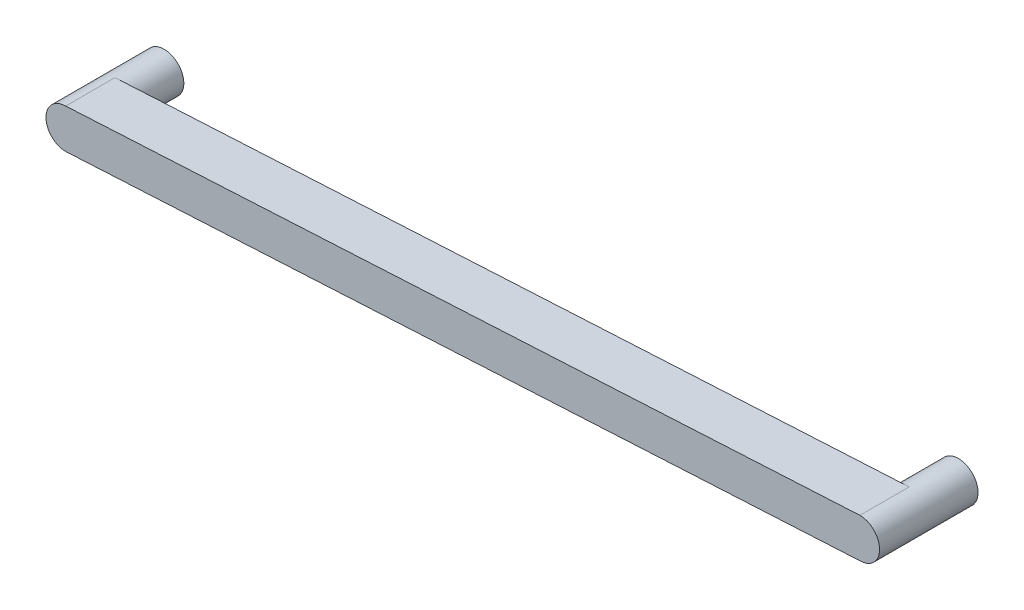
ISO-10303-21;
HEADER;
FILE_DESCRIPTION(('STEP AP214'),'2;1');
FILE_NAME('part.step','',(''),(''),'','','');
FILE_SCHEMA(('AUTOMOTIVE_DESIGN { 1 0 10303 214 1 1 1 1 }'));
ENDSEC;
DATA;
#1=APPLICATION_CONTEXT('core data for automotive mechanical design processes');
#2=APPLICATION_PROTOCOL_DEFINITION('international standard','automotive_design',2000,#1);
#3=PRODUCT_CONTEXT('',#1,'mechanical');
#4=PRODUCT('Part','Part','',(#3));
#5=PRODUCT_RELATED_PRODUCT_CATEGORY('part','',(#4));
#6=PRODUCT_DEFINITION_FORMATION('','',#4);
#7=PRODUCT_DEFINITION_CONTEXT('part definition',#1,'design');
#8=PRODUCT_DEFINITION('design','',#6,#7);
#9=PRODUCT_DEFINITION_SHAPE('','',#8);
#10=(LENGTH_UNIT() NAMED_UNIT(*) SI_UNIT(.MILLI.,.METRE.));
#11=(NAMED_UNIT(*) PLANE_ANGLE_UNIT() SI_UNIT($,.RADIAN.));
#12=(NAMED_UNIT(*) SI_UNIT($,.STERADIAN.) SOLID_ANGLE_UNIT());
#13=UNCERTAINTY_MEASURE_WITH_UNIT(LENGTH_MEASURE(1.E-05),#10,'distance_accuracy_value','');
#14=(GEOMETRIC_REPRESENTATION_CONTEXT(3) GLOBAL_UNCERTAINTY_ASSIGNED_CONTEXT((#13)) GLOBAL_UNIT_ASSIGNED_CONTEXT((#10,
#11,#12)) REPRESENTATION_CONTEXT('',''));
#15=CARTESIAN_POINT('',(0.,0.,0.));
#16=DIRECTION('',(0.,0.,1.));
#17=DIRECTION('',(1.,0.,0.));
#18=AXIS2_PLACEMENT_3D('',#15,#16,#17);
#19=CARTESIAN_POINT('',(0.,0.,1.5));
#20=DIRECTION('',(0.,0.,-1.));
#21=DIRECTION('',(-1.,0.,0.));
#22=AXIS2_PLACEMENT_3D('',#19,#20,#21);
#23=CYLINDRICAL_SURFACE('',#22,0.6);
#24=DIRECTION('',(0.,0.,-1.));
#25=VECTOR('',#24,1.);
#26=CARTESIAN_POINT('',(0.,0.6,1.5));
#27=LINE('',#26,#25);
#28=CARTESIAN_POINT('',(0.,0.6,1.5));
#29=VERTEX_POINT('',#28);
#30=CARTESIAN_POINT('',(0.,0.6,0.));
#31=VERTEX_POINT('',#30);
#32=EDGE_CURVE('E123',#29,#31,#27,.T.);
#33=ORIENTED_EDGE('',*,*,#32,.T.);
#34=CARTESIAN_POINT('',(0.,0.,0.));
#35=DIRECTION('',(0.,0.,-1.));
#36=DIRECTION('',(-1.,0.,0.));
#37=AXIS2_PLACEMENT_3D('',#34,#35,#36);
#38=CIRCLE('',#37,0.6);
#39=CARTESIAN_POINT('',(0.0642773227997892,-0.5965470859653,0.));
#40=VERTEX_POINT('',#39);
#41=EDGE_CURVE('E91',#31,#40,#38,.T.);
#42=ORIENTED_EDGE('',*,*,#41,.T.);
#43=CARTESIAN_POINT('',(0.,-0.6,0.));
#44=DIRECTION('',(0.998560249377948,0.053641666288898,0.));
#45=VECTOR('',#44,1.);
#46=LINE('',#43,#45);
#47=CARTESIAN_POINT('',(0.,-0.6,0.));
#48=VERTEX_POINT('',#47);
#49=EDGE_CURVE('E104',#48,#40,#46,.T.);
#50=ORIENTED_EDGE('',*,*,#49,.F.);
#51=DIRECTION('',(0.,0.,-1.));
#52=VECTOR('',#51,1.);
#53=CARTESIAN_POINT('',(0.,-0.6,1.5));
#54=LINE('',#53,#52);
#55=CARTESIAN_POINT('',(0.,-0.6,1.5));
#56=VERTEX_POINT('',#55);
#57=EDGE_CURVE('E57',#56,#48,#54,.T.);
#58=ORIENTED_EDGE('',*,*,#57,.F.);
#59=CARTESIAN_POINT('',(0.,0.,1.5));
#60=DIRECTION('',(0.,0.,1.));
#61=DIRECTION('',(1.,0.,0.));
#62=AXIS2_PLACEMENT_3D('',#59,#60,#61);
#63=CIRCLE('',#62,0.6);
#64=EDGE_CURVE('E136',#29,#56,#63,.T.);
#65=ORIENTED_EDGE('',*,*,#64,.F.);
#66=EDGE_LOOP('',(#33,#42,#50,#58,#65));
#67=FACE_BOUND('',#66,.T.);
#68=CARTESIAN_POINT('',(0.,0.,-1.5));
#69=DIRECTION('',(0.,0.,-1.));
#70=DIRECTION('',(-1.,0.,0.));
#71=AXIS2_PLACEMENT_3D('',#68,#69,#70);
#72=CIRCLE('',#71,0.6);
#73=CARTESIAN_POINT('',(-0.6,0.,-1.5));
#74=VERTEX_POINT('',#73);
#75=EDGE_CURVE('E125',#74,#74,#72,.T.);
#76=ORIENTED_EDGE('',*,*,#75,.F.);
#77=EDGE_LOOP('',(#76));
#78=FACE_BOUND('',#77,.T.);
#79=ADVANCED_FACE('F45',(#67,#78),#23,.T.);
#80=CARTESIAN_POINT('',(0.,-0.6,1.5));
#81=DIRECTION('',(-0.053641666288898,0.998560249377948,0.));
#82=DIRECTION('',(-0.998560249377948,-0.053641666288898,0.));
#83=AXIS2_PLACEMENT_3D('',#80,#81,#82);
#84=PLANE('',#83);
#85=ORIENTED_EDGE('',*,*,#49,.T.);
#86=DIRECTION('',(0.998560249377948,0.053641666288898,0.));
#87=VECTOR('',#86,1.);
#88=CARTESIAN_POINT('',(0.,-0.6,0.));
#89=LINE('',#88,#87);
#90=CARTESIAN_POINT('',(24.2,0.7,0.));
#91=VERTEX_POINT('',#90);
#92=EDGE_CURVE('E107',#40,#91,#89,.T.);
#93=ORIENTED_EDGE('',*,*,#92,.T.);
#94=DIRECTION('',(0.,0.,-1.));
#95=VECTOR('',#94,1.);
#96=CARTESIAN_POINT('',(24.2,0.7,1.5));
#97=LINE('',#96,#95);
#98=CARTESIAN_POINT('',(24.2,0.7,1.5));
#99=VERTEX_POINT('',#98);
#100=EDGE_CURVE('E149',#99,#91,#97,.T.);
#101=ORIENTED_EDGE('',*,*,#100,.F.);
#102=DIRECTION('',(0.998560249377948,0.053641666288898,0.));
#103=VECTOR('',#102,1.);
#104=CARTESIAN_POINT('',(0.,-0.6,1.5));
#105=LINE('',#104,#103);
#106=EDGE_CURVE('E98',#56,#99,#105,.T.);
#107=ORIENTED_EDGE('',*,*,#106,.F.);
#108=ORIENTED_EDGE('',*,*,#57,.T.);
#109=EDGE_LOOP('',(#85,#93,#101,#107,#108));
#110=FACE_BOUND('',#109,.T.);
#111=ADVANCED_FACE('F106',(#110),#84,.F.);
#112=CARTESIAN_POINT('',(24.2,1.3,1.5));
#113=DIRECTION('',(0.,0.,-1.));
#114=DIRECTION('',(-1.,0.,0.));
#115=AXIS2_PLACEMENT_3D('',#112,#113,#114);
#116=CYLINDRICAL_SURFACE('',#115,0.6);
#117=ORIENTED_EDGE('',*,*,#100,.T.);
#118=CARTESIAN_POINT('',(24.2,1.3,0.));
#119=DIRECTION('',(0.,0.,-1.));
#120=DIRECTION('',(-1.,0.,0.));
#121=AXIS2_PLACEMENT_3D('',#118,#119,#120);
#122=CIRCLE('',#121,0.6);
#123=CARTESIAN_POINT('',(24.1357226772002,1.8965470859653,0.));
#124=VERTEX_POINT('',#123);
#125=EDGE_CURVE('E11',#91,#124,#122,.T.);
#126=ORIENTED_EDGE('',*,*,#125,.T.);
#127=CARTESIAN_POINT('',(24.2,1.9,0.));
#128=DIRECTION('',(-0.998560249377949,-0.0536416662888963,0.));
#129=VECTOR('',#128,1.);
#130=LINE('',#127,#129);
#131=CARTESIAN_POINT('',(24.2,1.9,0.));
#132=VERTEX_POINT('',#131);
#133=EDGE_CURVE('E139',#132,#124,#130,.T.);
#134=ORIENTED_EDGE('',*,*,#133,.F.);
#135=DIRECTION('',(0.,0.,-1.));
#136=VECTOR('',#135,1.);
#137=CARTESIAN_POINT('',(24.2,1.9,1.5));
#138=LINE('',#137,#136);
#139=CARTESIAN_POINT('',(24.2,1.9,1.5));
#140=VERTEX_POINT('',#139);
#141=EDGE_CURVE('E83',#140,#132,#138,.T.);
#142=ORIENTED_EDGE('',*,*,#141,.F.);
#143=CARTESIAN_POINT('',(24.2,1.3,1.5));
#144=DIRECTION('',(0.,0.,1.));
#145=DIRECTION('',(1.,0.,0.));
#146=AXIS2_PLACEMENT_3D('',#143,#144,#145);
#147=CIRCLE('',#146,0.6);
#148=EDGE_CURVE('E142',#99,#140,#147,.T.);
#149=ORIENTED_EDGE('',*,*,#148,.F.);
#150=EDGE_LOOP('',(#117,#126,#134,#142,#149));
#151=FACE_BOUND('',#150,.T.);
#152=CARTESIAN_POINT('',(24.2,1.3,-1.5));
#153=DIRECTION('',(0.,0.,-1.));
#154=DIRECTION('',(-1.,0.,0.));
#155=AXIS2_PLACEMENT_3D('',#152,#153,#154);
#156=CIRCLE('',#155,0.6);
#157=CARTESIAN_POINT('',(23.6,1.3,-1.5));
#158=VERTEX_POINT('',#157);
#159=EDGE_CURVE('E118',#158,#158,#156,.T.);
#160=ORIENTED_EDGE('',*,*,#159,.F.);
#161=EDGE_LOOP('',(#160));
#162=FACE_BOUND('',#161,.T.);
#163=ADVANCED_FACE('F167',(#151,#162),#116,.T.);
#164=CARTESIAN_POINT('',(0.,0.6,1.5));
#165=DIRECTION('',(0.053641666288898,-0.998560249377948,0.));
#166=DIRECTION('',(0.998560249377948,0.053641666288898,0.));
#167=AXIS2_PLACEMENT_3D('',#164,#165,#166);
#168=PLANE('',#167);
#169=ORIENTED_EDGE('',*,*,#133,.T.);
#170=DIRECTION('',(-0.998560249377948,-0.053641666288898,0.));
#171=VECTOR('',#170,1.);
#172=CARTESIAN_POINT('',(0.,0.6,0.));
#173=LINE('',#172,#171);
#174=EDGE_CURVE('E112',#124,#31,#173,.T.);
#175=ORIENTED_EDGE('',*,*,#174,.T.);
#176=ORIENTED_EDGE('',*,*,#32,.F.);
#177=DIRECTION('',(-0.998560249377948,-0.053641666288898,0.));
#178=VECTOR('',#177,1.);
#179=CARTESIAN_POINT('',(0.,0.6,1.5));
#180=LINE('',#179,#178);
#181=EDGE_CURVE('E66',#140,#29,#180,.T.);
#182=ORIENTED_EDGE('',*,*,#181,.F.);
#183=ORIENTED_EDGE('',*,*,#141,.T.);
#184=EDGE_LOOP('',(#169,#175,#176,#182,#183));
#185=FACE_BOUND('',#184,.T.);
#186=ADVANCED_FACE('F176',(#185),#168,.F.);
#187=CARTESIAN_POINT('',(0.,0.,1.5));
#188=DIRECTION('',(0.,0.,1.));
#189=DIRECTION('',(1.,0.,0.));
#190=AXIS2_PLACEMENT_3D('',#187,#188,#189);
#191=PLANE('',#190);
#192=ORIENTED_EDGE('',*,*,#64,.T.);
#193=ORIENTED_EDGE('',*,*,#106,.T.);
#194=ORIENTED_EDGE('',*,*,#148,.T.);
#195=ORIENTED_EDGE('',*,*,#181,.T.);
#196=EDGE_LOOP('',(#192,#193,#194,#195));
#197=FACE_BOUND('',#196,.T.);
#198=ADVANCED_FACE('F198',(#197),#191,.T.);
#199=CARTESIAN_POINT('',(0.,0.,0.));
#200=DIRECTION('',(0.,0.,1.));
#201=DIRECTION('',(1.,0.,0.));
#202=AXIS2_PLACEMENT_3D('',#199,#200,#201);
#203=PLANE('',#202);
#204=ORIENTED_EDGE('',*,*,#41,.F.);
#205=ORIENTED_EDGE('',*,*,#174,.F.);
#206=ORIENTED_EDGE('',*,*,#125,.F.);
#207=ORIENTED_EDGE('',*,*,#92,.F.);
#208=EDGE_LOOP('',(#204,#205,#206,#207));
#209=FACE_BOUND('',#208,.T.);
#210=ADVANCED_FACE('F115',(#209),#203,.F.);
#211=CARTESIAN_POINT('',(24.2,1.3,-1.5));
#212=DIRECTION('',(0.,0.,-1.));
#213=DIRECTION('',(-1.,0.,0.));
#214=AXIS2_PLACEMENT_3D('',#211,#212,#213);
#215=PLANE('',#214);
#216=ORIENTED_EDGE('',*,*,#159,.T.);
#217=EDGE_LOOP('',(#216));
#218=FACE_BOUND('',#217,.T.);
#219=ADVANCED_FACE('F205',(#218),#215,.T.);
#220=CARTESIAN_POINT('',(0.,0.,-1.5));
#221=DIRECTION('',(0.,0.,-1.));
#222=DIRECTION('',(-1.,0.,0.));
#223=AXIS2_PLACEMENT_3D('',#220,#221,#222);
#224=PLANE('',#223);
#225=ORIENTED_EDGE('',*,*,#75,.T.);
#226=EDGE_LOOP('',(#225));
#227=FACE_BOUND('',#226,.T.);
#228=ADVANCED_FACE('F237',(#227),#224,.T.);
#229=CLOSED_SHELL('',(#79,#111,#163,#186,#198,#210,#219,#228));
#230=MANIFOLD_SOLID_BREP('B2',#229);
#231=ADVANCED_BREP_SHAPE_REPRESENTATION('',(#18,#230),#14);
#232=SHAPE_DEFINITION_REPRESENTATION(#9,#231);
ENDSEC;
END-ISO-10303-21;
